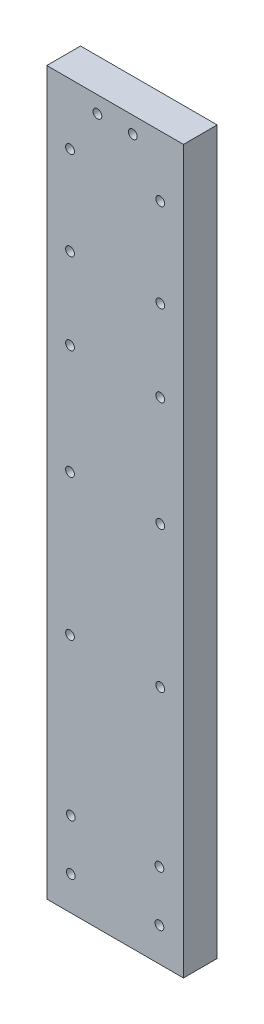
ISO-10303-21;
HEADER;
FILE_DESCRIPTION(('STEP AP214'),'2;1');
FILE_NAME('part.step','',(''),(''),'','','');
FILE_SCHEMA(('AUTOMOTIVE_DESIGN { 1 0 10303 214 1 1 1 1 }'));
ENDSEC;
DATA;
#1=APPLICATION_CONTEXT('core data for automotive mechanical design processes');
#2=APPLICATION_PROTOCOL_DEFINITION('international standard','automotive_design',2000,#1);
#3=PRODUCT_CONTEXT('',#1,'mechanical');
#4=PRODUCT('Part','Part','',(#3));
#5=PRODUCT_RELATED_PRODUCT_CATEGORY('part','',(#4));
#6=PRODUCT_DEFINITION_FORMATION('','',#4);
#7=PRODUCT_DEFINITION_CONTEXT('part definition',#1,'design');
#8=PRODUCT_DEFINITION('design','',#6,#7);
#9=PRODUCT_DEFINITION_SHAPE('','',#8);
#10=(LENGTH_UNIT() NAMED_UNIT(*) SI_UNIT(.MILLI.,.METRE.));
#11=(NAMED_UNIT(*) PLANE_ANGLE_UNIT() SI_UNIT($,.RADIAN.));
#12=(NAMED_UNIT(*) SI_UNIT($,.STERADIAN.) SOLID_ANGLE_UNIT());
#13=UNCERTAINTY_MEASURE_WITH_UNIT(LENGTH_MEASURE(1.E-05),#10,'distance_accuracy_value','');
#14=(GEOMETRIC_REPRESENTATION_CONTEXT(3) GLOBAL_UNCERTAINTY_ASSIGNED_CONTEXT((#13)) GLOBAL_UNIT_ASSIGNED_CONTEXT((#10,
#11,#12)) REPRESENTATION_CONTEXT('',''));
#15=CARTESIAN_POINT('',(0.,0.,0.));
#16=DIRECTION('',(0.,0.,1.));
#17=DIRECTION('',(1.,0.,0.));
#18=AXIS2_PLACEMENT_3D('',#15,#16,#17);
#19=CARTESIAN_POINT('',(0.,0.,4.));
#20=DIRECTION('',(0.,0.,-1.));
#21=DIRECTION('',(-1.,0.,0.));
#22=AXIS2_PLACEMENT_3D('',#19,#20,#21);
#23=PLANE('',#22);
#24=CARTESIAN_POINT('',(10.2,83.635,4.));
#25=DIRECTION('',(0.,0.,1.));
#26=DIRECTION('',(1.,0.,0.));
#27=AXIS2_PLACEMENT_3D('',#24,#25,#26);
#28=CIRCLE('',#27,0.519960121099865);
#29=CARTESIAN_POINT('',(10.7199601210999,83.635,4.));
#30=VERTEX_POINT('',#29);
#31=EDGE_CURVE('E193',#30,#30,#28,.T.);
#32=ORIENTED_EDGE('',*,*,#31,.F.);
#33=EDGE_LOOP('',(#32));
#34=FACE_BOUND('',#33,.T.);
#35=CARTESIAN_POINT('',(13.45,78.385,4.));
#36=DIRECTION('',(0.,0.,1.));
#37=DIRECTION('',(1.,0.,0.));
#38=AXIS2_PLACEMENT_3D('',#35,#36,#37);
#39=CIRCLE('',#38,0.519960121099861);
#40=CARTESIAN_POINT('',(13.9699601210999,78.385,4.));
#41=VERTEX_POINT('',#40);
#42=EDGE_CURVE('E181',#41,#41,#39,.T.);
#43=ORIENTED_EDGE('',*,*,#42,.F.);
#44=EDGE_LOOP('',(#43));
#45=FACE_BOUND('',#44,.T.);
#46=CARTESIAN_POINT('',(13.35,4.,4.));
#47=DIRECTION('',(0.,0.,1.));
#48=DIRECTION('',(-1.,0.,0.));
#49=AXIS2_PLACEMENT_3D('',#46,#47,#48);
#50=CIRCLE('',#49,0.519960121099866);
#51=CARTESIAN_POINT('',(12.8300398789001,4.,4.));
#52=VERTEX_POINT('',#51);
#53=EDGE_CURVE('E169',#52,#52,#50,.T.);
#54=ORIENTED_EDGE('',*,*,#53,.F.);
#55=EDGE_LOOP('',(#54));
#56=FACE_BOUND('',#55,.T.);
#57=CARTESIAN_POINT('',(2.85,4.,4.));
#58=DIRECTION('',(0.,0.,1.));
#59=DIRECTION('',(1.,0.,0.));
#60=AXIS2_PLACEMENT_3D('',#57,#58,#59);
#61=CIRCLE('',#60,0.519960121099866);
#62=CARTESIAN_POINT('',(3.36996012109987,4.,4.));
#63=VERTEX_POINT('',#62);
#64=EDGE_CURVE('E157',#63,#63,#61,.T.);
#65=ORIENTED_EDGE('',*,*,#64,.F.);
#66=EDGE_LOOP('',(#65));
#67=FACE_BOUND('',#66,.T.);
#68=CARTESIAN_POINT('',(13.45,67.885,4.));
#69=DIRECTION('',(0.,0.,1.));
#70=DIRECTION('',(1.,0.,0.));
#71=AXIS2_PLACEMENT_3D('',#68,#69,#70);
#72=CIRCLE('',#71,0.519960121099861);
#73=CARTESIAN_POINT('',(13.9699601210999,67.885,4.));
#74=VERTEX_POINT('',#73);
#75=EDGE_CURVE('E145',#74,#74,#72,.T.);
#76=ORIENTED_EDGE('',*,*,#75,.F.);
#77=EDGE_LOOP('',(#76));
#78=FACE_BOUND('',#77,.T.);
#79=CARTESIAN_POINT('',(13.45,58.24,4.));
#80=DIRECTION('',(0.,0.,1.));
#81=DIRECTION('',(1.,0.,0.));
#82=AXIS2_PLACEMENT_3D('',#79,#80,#81);
#83=CIRCLE('',#82,0.519960121099861);
#84=CARTESIAN_POINT('',(13.9699601210999,58.24,4.));
#85=VERTEX_POINT('',#84);
#86=EDGE_CURVE('E133',#85,#85,#83,.T.);
#87=ORIENTED_EDGE('',*,*,#86,.F.);
#88=EDGE_LOOP('',(#87));
#89=FACE_BOUND('',#88,.T.);
#90=CARTESIAN_POINT('',(13.45,45.24,4.));
#91=DIRECTION('',(0.,0.,1.));
#92=DIRECTION('',(1.,0.,0.));
#93=AXIS2_PLACEMENT_3D('',#90,#91,#92);
#94=CIRCLE('',#93,0.519960121099861);
#95=CARTESIAN_POINT('',(13.9699601210999,45.24,4.));
#96=VERTEX_POINT('',#95);
#97=EDGE_CURVE('E121',#96,#96,#94,.T.);
#98=ORIENTED_EDGE('',*,*,#97,.F.);
#99=EDGE_LOOP('',(#98));
#100=FACE_BOUND('',#99,.T.);
#101=CARTESIAN_POINT('',(13.45,28.5,4.));
#102=DIRECTION('',(0.,0.,1.));
#103=DIRECTION('',(1.,0.,0.));
#104=AXIS2_PLACEMENT_3D('',#101,#102,#103);
#105=CIRCLE('',#104,0.519960121099865);
#106=CARTESIAN_POINT('',(13.9699601210999,28.5,4.));
#107=VERTEX_POINT('',#106);
#108=EDGE_CURVE('E100',#107,#107,#105,.T.);
#109=ORIENTED_EDGE('',*,*,#108,.F.);
#110=EDGE_LOOP('',(#109));
#111=FACE_BOUND('',#110,.T.);
#112=DIRECTION('',(-1.,0.,0.));
#113=VECTOR('',#112,1.);
#114=CARTESIAN_POINT('',(16.2,85.59,4.));
#115=LINE('',#114,#113);
#116=CARTESIAN_POINT('',(16.2,85.59,4.));
#117=VERTEX_POINT('',#116);
#118=CARTESIAN_POINT('',(0.,85.59,4.));
#119=VERTEX_POINT('',#118);
#120=EDGE_CURVE('E85',#117,#119,#115,.T.);
#121=ORIENTED_EDGE('',*,*,#120,.T.);
#122=DIRECTION('',(0.,-1.,0.));
#123=VECTOR('',#122,1.);
#124=CARTESIAN_POINT('',(0.,0.,4.));
#125=LINE('',#124,#123);
#126=CARTESIAN_POINT('',(0.,0.,4.));
#127=VERTEX_POINT('',#126);
#128=EDGE_CURVE('E80',#119,#127,#125,.T.);
#129=ORIENTED_EDGE('',*,*,#128,.T.);
#130=DIRECTION('',(1.,0.,0.));
#131=VECTOR('',#130,1.);
#132=CARTESIAN_POINT('',(0.,0.,4.));
#133=LINE('',#132,#131);
#134=CARTESIAN_POINT('',(16.2,0.,4.));
#135=VERTEX_POINT('',#134);
#136=EDGE_CURVE('E83',#127,#135,#133,.T.);
#137=ORIENTED_EDGE('',*,*,#136,.T.);
#138=DIRECTION('',(0.,1.,0.));
#139=VECTOR('',#138,1.);
#140=CARTESIAN_POINT('',(16.2,0.,4.));
#141=LINE('',#140,#139);
#142=EDGE_CURVE('E50',#135,#117,#141,.T.);
#143=ORIENTED_EDGE('',*,*,#142,.T.);
#144=EDGE_LOOP('',(#121,#129,#137,#143));
#145=FACE_BOUND('',#144,.T.);
#146=CARTESIAN_POINT('',(2.75,28.5,4.));
#147=DIRECTION('',(0.,0.,1.));
#148=DIRECTION('',(1.,0.,0.));
#149=AXIS2_PLACEMENT_3D('',#146,#147,#148);
#150=CIRCLE('',#149,0.519960121099867);
#151=CARTESIAN_POINT('',(3.26996012109987,28.5,4.));
#152=VERTEX_POINT('',#151);
#153=EDGE_CURVE('E115',#152,#152,#150,.T.);
#154=ORIENTED_EDGE('',*,*,#153,.F.);
#155=EDGE_LOOP('',(#154));
#156=FACE_BOUND('',#155,.T.);
#157=CARTESIAN_POINT('',(2.75,45.24,4.));
#158=DIRECTION('',(0.,0.,1.));
#159=DIRECTION('',(1.,0.,0.));
#160=AXIS2_PLACEMENT_3D('',#157,#158,#159);
#161=CIRCLE('',#160,0.519960121099858);
#162=CARTESIAN_POINT('',(3.26996012109986,45.24,4.));
#163=VERTEX_POINT('',#162);
#164=EDGE_CURVE('E127',#163,#163,#161,.T.);
#165=ORIENTED_EDGE('',*,*,#164,.F.);
#166=EDGE_LOOP('',(#165));
#167=FACE_BOUND('',#166,.T.);
#168=CARTESIAN_POINT('',(2.75,58.24,4.));
#169=DIRECTION('',(0.,0.,1.));
#170=DIRECTION('',(1.,0.,0.));
#171=AXIS2_PLACEMENT_3D('',#168,#169,#170);
#172=CIRCLE('',#171,0.519960121099858);
#173=CARTESIAN_POINT('',(3.26996012109986,58.24,4.));
#174=VERTEX_POINT('',#173);
#175=EDGE_CURVE('E139',#174,#174,#172,.T.);
#176=ORIENTED_EDGE('',*,*,#175,.F.);
#177=EDGE_LOOP('',(#176));
#178=FACE_BOUND('',#177,.T.);
#179=CARTESIAN_POINT('',(2.85,10.,4.));
#180=DIRECTION('',(0.,0.,1.));
#181=DIRECTION('',(1.,0.,0.));
#182=AXIS2_PLACEMENT_3D('',#179,#180,#181);
#183=CIRCLE('',#182,0.519960121099866);
#184=CARTESIAN_POINT('',(3.36996012109986,10.,4.));
#185=VERTEX_POINT('',#184);
#186=EDGE_CURVE('E151',#185,#185,#183,.T.);
#187=ORIENTED_EDGE('',*,*,#186,.F.);
#188=EDGE_LOOP('',(#187));
#189=FACE_BOUND('',#188,.T.);
#190=CARTESIAN_POINT('',(13.3499999999999,10.,4.));
#191=DIRECTION('',(0.,0.,1.));
#192=DIRECTION('',(-1.,0.,0.));
#193=AXIS2_PLACEMENT_3D('',#190,#191,#192);
#194=CIRCLE('',#193,0.519960121099864);
#195=CARTESIAN_POINT('',(12.8300398789,10.,4.));
#196=VERTEX_POINT('',#195);
#197=EDGE_CURVE('E163',#196,#196,#194,.T.);
#198=ORIENTED_EDGE('',*,*,#197,.F.);
#199=EDGE_LOOP('',(#198));
#200=FACE_BOUND('',#199,.T.);
#201=CARTESIAN_POINT('',(2.74999999999862,67.885,4.));
#202=DIRECTION('',(0.,0.,1.));
#203=DIRECTION('',(1.,0.,0.));
#204=AXIS2_PLACEMENT_3D('',#201,#202,#203);
#205=CIRCLE('',#204,0.519960121099858);
#206=CARTESIAN_POINT('',(3.26996012109847,67.885,4.));
#207=VERTEX_POINT('',#206);
#208=EDGE_CURVE('E175',#207,#207,#205,.T.);
#209=ORIENTED_EDGE('',*,*,#208,.F.);
#210=EDGE_LOOP('',(#209));
#211=FACE_BOUND('',#210,.T.);
#212=CARTESIAN_POINT('',(2.74999999999862,78.385,4.));
#213=DIRECTION('',(0.,0.,1.));
#214=DIRECTION('',(1.,0.,0.));
#215=AXIS2_PLACEMENT_3D('',#212,#213,#214);
#216=CIRCLE('',#215,0.519960121099858);
#217=CARTESIAN_POINT('',(3.26996012109847,78.385,4.));
#218=VERTEX_POINT('',#217);
#219=EDGE_CURVE('E187',#218,#218,#216,.T.);
#220=ORIENTED_EDGE('',*,*,#219,.F.);
#221=EDGE_LOOP('',(#220));
#222=FACE_BOUND('',#221,.T.);
#223=CARTESIAN_POINT('',(6.,83.635,4.));
#224=DIRECTION('',(0.,0.,1.));
#225=DIRECTION('',(1.,0.,0.));
#226=AXIS2_PLACEMENT_3D('',#223,#224,#225);
#227=CIRCLE('',#226,0.519960121099862);
#228=CARTESIAN_POINT('',(6.51996012109986,83.635,4.));
#229=VERTEX_POINT('',#228);
#230=EDGE_CURVE('E199',#229,#229,#227,.T.);
#231=ORIENTED_EDGE('',*,*,#230,.F.);
#232=EDGE_LOOP('',(#231));
#233=FACE_BOUND('',#232,.T.);
#234=ADVANCED_FACE('F33',(#34,#45,#56,#67,#78,#89,#100,#111,#145,#156,#167,#178,#189,#200,#211,
#222,#233),#23,.F.);
#235=CARTESIAN_POINT('',(0.,0.,0.));
#236=DIRECTION('',(0.,0.,-1.));
#237=DIRECTION('',(-1.,0.,0.));
#238=AXIS2_PLACEMENT_3D('',#235,#236,#237);
#239=PLANE('',#238);
#240=CARTESIAN_POINT('',(10.2,83.635,0.));
#241=DIRECTION('',(0.,0.,1.));
#242=DIRECTION('',(1.,0.,0.));
#243=AXIS2_PLACEMENT_3D('',#240,#241,#242);
#244=CIRCLE('',#243,0.519960121099865);
#245=CARTESIAN_POINT('',(10.7199601210999,83.635,0.));
#246=VERTEX_POINT('',#245);
#247=EDGE_CURVE('E196',#246,#246,#244,.T.);
#248=ORIENTED_EDGE('',*,*,#247,.T.);
#249=EDGE_LOOP('',(#248));
#250=FACE_BOUND('',#249,.T.);
#251=CARTESIAN_POINT('',(13.45,78.385,0.));
#252=DIRECTION('',(0.,0.,1.));
#253=DIRECTION('',(1.,0.,0.));
#254=AXIS2_PLACEMENT_3D('',#251,#252,#253);
#255=CIRCLE('',#254,0.519960121099861);
#256=CARTESIAN_POINT('',(13.9699601210999,78.385,0.));
#257=VERTEX_POINT('',#256);
#258=EDGE_CURVE('E184',#257,#257,#255,.T.);
#259=ORIENTED_EDGE('',*,*,#258,.T.);
#260=EDGE_LOOP('',(#259));
#261=FACE_BOUND('',#260,.T.);
#262=CARTESIAN_POINT('',(13.35,4.,0.));
#263=DIRECTION('',(0.,0.,1.));
#264=DIRECTION('',(-1.,0.,0.));
#265=AXIS2_PLACEMENT_3D('',#262,#263,#264);
#266=CIRCLE('',#265,0.519960121099866);
#267=CARTESIAN_POINT('',(12.8300398789001,4.,0.));
#268=VERTEX_POINT('',#267);
#269=EDGE_CURVE('E172',#268,#268,#266,.T.);
#270=ORIENTED_EDGE('',*,*,#269,.T.);
#271=EDGE_LOOP('',(#270));
#272=FACE_BOUND('',#271,.T.);
#273=CARTESIAN_POINT('',(2.85,4.,0.));
#274=DIRECTION('',(0.,0.,1.));
#275=DIRECTION('',(1.,0.,0.));
#276=AXIS2_PLACEMENT_3D('',#273,#274,#275);
#277=CIRCLE('',#276,0.519960121099866);
#278=CARTESIAN_POINT('',(3.36996012109987,4.,0.));
#279=VERTEX_POINT('',#278);
#280=EDGE_CURVE('E160',#279,#279,#277,.T.);
#281=ORIENTED_EDGE('',*,*,#280,.T.);
#282=EDGE_LOOP('',(#281));
#283=FACE_BOUND('',#282,.T.);
#284=CARTESIAN_POINT('',(13.45,67.885,0.));
#285=DIRECTION('',(0.,0.,1.));
#286=DIRECTION('',(1.,0.,0.));
#287=AXIS2_PLACEMENT_3D('',#284,#285,#286);
#288=CIRCLE('',#287,0.519960121099861);
#289=CARTESIAN_POINT('',(13.9699601210999,67.885,0.));
#290=VERTEX_POINT('',#289);
#291=EDGE_CURVE('E148',#290,#290,#288,.T.);
#292=ORIENTED_EDGE('',*,*,#291,.T.);
#293=EDGE_LOOP('',(#292));
#294=FACE_BOUND('',#293,.T.);
#295=CARTESIAN_POINT('',(13.45,58.24,0.));
#296=DIRECTION('',(0.,0.,1.));
#297=DIRECTION('',(1.,0.,0.));
#298=AXIS2_PLACEMENT_3D('',#295,#296,#297);
#299=CIRCLE('',#298,0.519960121099861);
#300=CARTESIAN_POINT('',(13.9699601210999,58.24,0.));
#301=VERTEX_POINT('',#300);
#302=EDGE_CURVE('E136',#301,#301,#299,.T.);
#303=ORIENTED_EDGE('',*,*,#302,.T.);
#304=EDGE_LOOP('',(#303));
#305=FACE_BOUND('',#304,.T.);
#306=CARTESIAN_POINT('',(13.45,45.24,0.));
#307=DIRECTION('',(0.,0.,1.));
#308=DIRECTION('',(1.,0.,0.));
#309=AXIS2_PLACEMENT_3D('',#306,#307,#308);
#310=CIRCLE('',#309,0.519960121099861);
#311=CARTESIAN_POINT('',(13.9699601210999,45.24,0.));
#312=VERTEX_POINT('',#311);
#313=EDGE_CURVE('E124',#312,#312,#310,.T.);
#314=ORIENTED_EDGE('',*,*,#313,.T.);
#315=EDGE_LOOP('',(#314));
#316=FACE_BOUND('',#315,.T.);
#317=CARTESIAN_POINT('',(13.45,28.5,0.));
#318=DIRECTION('',(0.,0.,1.));
#319=DIRECTION('',(1.,0.,0.));
#320=AXIS2_PLACEMENT_3D('',#317,#318,#319);
#321=CIRCLE('',#320,0.519960121099865);
#322=CARTESIAN_POINT('',(13.9699601210999,28.5,0.));
#323=VERTEX_POINT('',#322);
#324=EDGE_CURVE('E112',#323,#323,#321,.T.);
#325=ORIENTED_EDGE('',*,*,#324,.T.);
#326=EDGE_LOOP('',(#325));
#327=FACE_BOUND('',#326,.T.);
#328=DIRECTION('',(-1.,0.,0.));
#329=VECTOR('',#328,1.);
#330=CARTESIAN_POINT('',(16.2,85.59,0.));
#331=LINE('',#330,#329);
#332=CARTESIAN_POINT('',(16.2,85.59,0.));
#333=VERTEX_POINT('',#332);
#334=CARTESIAN_POINT('',(0.,85.59,0.));
#335=VERTEX_POINT('',#334);
#336=EDGE_CURVE('E97',#333,#335,#331,.T.);
#337=ORIENTED_EDGE('',*,*,#336,.F.);
#338=DIRECTION('',(0.,1.,0.));
#339=VECTOR('',#338,1.);
#340=CARTESIAN_POINT('',(16.2,0.,0.));
#341=LINE('',#340,#339);
#342=CARTESIAN_POINT('',(16.2,0.,0.));
#343=VERTEX_POINT('',#342);
#344=EDGE_CURVE('E73',#343,#333,#341,.T.);
#345=ORIENTED_EDGE('',*,*,#344,.F.);
#346=DIRECTION('',(1.,0.,0.));
#347=VECTOR('',#346,1.);
#348=CARTESIAN_POINT('',(0.,0.,0.));
#349=LINE('',#348,#347);
#350=CARTESIAN_POINT('',(0.,0.,0.));
#351=VERTEX_POINT('',#350);
#352=EDGE_CURVE('E67',#351,#343,#349,.T.);
#353=ORIENTED_EDGE('',*,*,#352,.F.);
#354=DIRECTION('',(0.,-1.,0.));
#355=VECTOR('',#354,1.);
#356=CARTESIAN_POINT('',(0.,0.,0.));
#357=LINE('',#356,#355);
#358=EDGE_CURVE('E89',#335,#351,#357,.T.);
#359=ORIENTED_EDGE('',*,*,#358,.F.);
#360=EDGE_LOOP('',(#337,#345,#353,#359));
#361=FACE_BOUND('',#360,.T.);
#362=CARTESIAN_POINT('',(2.75,28.5,0.));
#363=DIRECTION('',(0.,0.,1.));
#364=DIRECTION('',(1.,0.,0.));
#365=AXIS2_PLACEMENT_3D('',#362,#363,#364);
#366=CIRCLE('',#365,0.519960121099867);
#367=CARTESIAN_POINT('',(3.26996012109987,28.5,0.));
#368=VERTEX_POINT('',#367);
#369=EDGE_CURVE('E118',#368,#368,#366,.T.);
#370=ORIENTED_EDGE('',*,*,#369,.T.);
#371=EDGE_LOOP('',(#370));
#372=FACE_BOUND('',#371,.T.);
#373=CARTESIAN_POINT('',(2.75,45.24,0.));
#374=DIRECTION('',(0.,0.,1.));
#375=DIRECTION('',(1.,0.,0.));
#376=AXIS2_PLACEMENT_3D('',#373,#374,#375);
#377=CIRCLE('',#376,0.519960121099858);
#378=CARTESIAN_POINT('',(3.26996012109986,45.24,0.));
#379=VERTEX_POINT('',#378);
#380=EDGE_CURVE('E130',#379,#379,#377,.T.);
#381=ORIENTED_EDGE('',*,*,#380,.T.);
#382=EDGE_LOOP('',(#381));
#383=FACE_BOUND('',#382,.T.);
#384=CARTESIAN_POINT('',(2.75,58.24,0.));
#385=DIRECTION('',(0.,0.,1.));
#386=DIRECTION('',(1.,0.,0.));
#387=AXIS2_PLACEMENT_3D('',#384,#385,#386);
#388=CIRCLE('',#387,0.519960121099858);
#389=CARTESIAN_POINT('',(3.26996012109986,58.24,0.));
#390=VERTEX_POINT('',#389);
#391=EDGE_CURVE('E142',#390,#390,#388,.T.);
#392=ORIENTED_EDGE('',*,*,#391,.T.);
#393=EDGE_LOOP('',(#392));
#394=FACE_BOUND('',#393,.T.);
#395=CARTESIAN_POINT('',(2.85,10.,0.));
#396=DIRECTION('',(0.,0.,1.));
#397=DIRECTION('',(1.,0.,0.));
#398=AXIS2_PLACEMENT_3D('',#395,#396,#397);
#399=CIRCLE('',#398,0.519960121099866);
#400=CARTESIAN_POINT('',(3.36996012109986,10.,0.));
#401=VERTEX_POINT('',#400);
#402=EDGE_CURVE('E154',#401,#401,#399,.T.);
#403=ORIENTED_EDGE('',*,*,#402,.T.);
#404=EDGE_LOOP('',(#403));
#405=FACE_BOUND('',#404,.T.);
#406=CARTESIAN_POINT('',(13.3499999999999,10.,0.));
#407=DIRECTION('',(0.,0.,1.));
#408=DIRECTION('',(-1.,0.,0.));
#409=AXIS2_PLACEMENT_3D('',#406,#407,#408);
#410=CIRCLE('',#409,0.519960121099864);
#411=CARTESIAN_POINT('',(12.8300398789,10.,0.));
#412=VERTEX_POINT('',#411);
#413=EDGE_CURVE('E166',#412,#412,#410,.T.);
#414=ORIENTED_EDGE('',*,*,#413,.T.);
#415=EDGE_LOOP('',(#414));
#416=FACE_BOUND('',#415,.T.);
#417=CARTESIAN_POINT('',(2.74999999999862,67.885,0.));
#418=DIRECTION('',(0.,0.,1.));
#419=DIRECTION('',(1.,0.,0.));
#420=AXIS2_PLACEMENT_3D('',#417,#418,#419);
#421=CIRCLE('',#420,0.519960121099858);
#422=CARTESIAN_POINT('',(3.26996012109847,67.885,0.));
#423=VERTEX_POINT('',#422);
#424=EDGE_CURVE('E178',#423,#423,#421,.T.);
#425=ORIENTED_EDGE('',*,*,#424,.T.);
#426=EDGE_LOOP('',(#425));
#427=FACE_BOUND('',#426,.T.);
#428=CARTESIAN_POINT('',(2.74999999999862,78.385,0.));
#429=DIRECTION('',(0.,0.,1.));
#430=DIRECTION('',(1.,0.,0.));
#431=AXIS2_PLACEMENT_3D('',#428,#429,#430);
#432=CIRCLE('',#431,0.519960121099858);
#433=CARTESIAN_POINT('',(3.26996012109847,78.385,0.));
#434=VERTEX_POINT('',#433);
#435=EDGE_CURVE('E190',#434,#434,#432,.T.);
#436=ORIENTED_EDGE('',*,*,#435,.T.);
#437=EDGE_LOOP('',(#436));
#438=FACE_BOUND('',#437,.T.);
#439=CARTESIAN_POINT('',(6.,83.635,0.));
#440=DIRECTION('',(0.,0.,1.));
#441=DIRECTION('',(1.,0.,0.));
#442=AXIS2_PLACEMENT_3D('',#439,#440,#441);
#443=CIRCLE('',#442,0.519960121099862);
#444=CARTESIAN_POINT('',(6.51996012109986,83.635,0.));
#445=VERTEX_POINT('',#444);
#446=EDGE_CURVE('E202',#445,#445,#443,.T.);
#447=ORIENTED_EDGE('',*,*,#446,.T.);
#448=EDGE_LOOP('',(#447));
#449=FACE_BOUND('',#448,.T.);
#450=ADVANCED_FACE('F108',(#250,#261,#272,#283,#294,#305,#316,#327,#361,#372,#383,#394,#405,
#416,#427,#438,#449),#239,.T.);
#451=CARTESIAN_POINT('',(16.2,85.59,4.));
#452=DIRECTION('',(0.,-1.,0.));
#453=DIRECTION('',(0.,0.,-1.));
#454=AXIS2_PLACEMENT_3D('',#451,#452,#453);
#455=PLANE('',#454);
#456=ORIENTED_EDGE('',*,*,#336,.T.);
#457=DIRECTION('',(0.,0.,-1.));
#458=VECTOR('',#457,1.);
#459=CARTESIAN_POINT('',(0.,85.59,4.));
#460=LINE('',#459,#458);
#461=EDGE_CURVE('E11',#119,#335,#460,.T.);
#462=ORIENTED_EDGE('',*,*,#461,.F.);
#463=ORIENTED_EDGE('',*,*,#120,.F.);
#464=DIRECTION('',(0.,0.,-1.));
#465=VECTOR('',#464,1.);
#466=CARTESIAN_POINT('',(16.2,85.59,4.));
#467=LINE('',#466,#465);
#468=EDGE_CURVE('E93',#117,#333,#467,.T.);
#469=ORIENTED_EDGE('',*,*,#468,.T.);
#470=EDGE_LOOP('',(#456,#462,#463,#469));
#471=FACE_BOUND('',#470,.T.);
#472=ADVANCED_FACE('F35',(#471),#455,.F.);
#473=CARTESIAN_POINT('',(0.,0.,4.));
#474=DIRECTION('',(1.,0.,0.));
#475=DIRECTION('',(0.,0.,-1.));
#476=AXIS2_PLACEMENT_3D('',#473,#474,#475);
#477=PLANE('',#476);
#478=ORIENTED_EDGE('',*,*,#358,.T.);
#479=DIRECTION('',(0.,0.,-1.));
#480=VECTOR('',#479,1.);
#481=CARTESIAN_POINT('',(0.,0.,4.));
#482=LINE('',#481,#480);
#483=EDGE_CURVE('E42',#127,#351,#482,.T.);
#484=ORIENTED_EDGE('',*,*,#483,.F.);
#485=ORIENTED_EDGE('',*,*,#128,.F.);
#486=ORIENTED_EDGE('',*,*,#461,.T.);
#487=EDGE_LOOP('',(#478,#484,#485,#486));
#488=FACE_BOUND('',#487,.T.);
#489=ADVANCED_FACE('F88',(#488),#477,.F.);
#490=CARTESIAN_POINT('',(0.,0.,4.));
#491=DIRECTION('',(0.,1.,0.));
#492=DIRECTION('',(0.,0.,1.));
#493=AXIS2_PLACEMENT_3D('',#490,#491,#492);
#494=PLANE('',#493);
#495=ORIENTED_EDGE('',*,*,#352,.T.);
#496=DIRECTION('',(0.,0.,-1.));
#497=VECTOR('',#496,1.);
#498=CARTESIAN_POINT('',(16.2,0.,4.));
#499=LINE('',#498,#497);
#500=EDGE_CURVE('E90',#135,#343,#499,.T.);
#501=ORIENTED_EDGE('',*,*,#500,.F.);
#502=ORIENTED_EDGE('',*,*,#136,.F.);
#503=ORIENTED_EDGE('',*,*,#483,.T.);
#504=EDGE_LOOP('',(#495,#501,#502,#503));
#505=FACE_BOUND('',#504,.T.);
#506=ADVANCED_FACE('F91',(#505),#494,.F.);
#507=CARTESIAN_POINT('',(16.2,0.,4.));
#508=DIRECTION('',(-1.,0.,0.));
#509=DIRECTION('',(0.,0.,1.));
#510=AXIS2_PLACEMENT_3D('',#507,#508,#509);
#511=PLANE('',#510);
#512=ORIENTED_EDGE('',*,*,#344,.T.);
#513=ORIENTED_EDGE('',*,*,#468,.F.);
#514=ORIENTED_EDGE('',*,*,#142,.F.);
#515=ORIENTED_EDGE('',*,*,#500,.T.);
#516=EDGE_LOOP('',(#512,#513,#514,#515));
#517=FACE_BOUND('',#516,.T.);
#518=ADVANCED_FACE('F105',(#517),#511,.F.);
#519=CARTESIAN_POINT('',(13.45,28.5,4.));
#520=DIRECTION('',(0.,0.,-1.));
#521=DIRECTION('',(-1.,0.,0.));
#522=AXIS2_PLACEMENT_3D('',#519,#520,#521);
#523=CYLINDRICAL_SURFACE('',#522,0.519960121099865);
#524=ORIENTED_EDGE('',*,*,#108,.T.);
#525=EDGE_LOOP('',(#524));
#526=FACE_BOUND('',#525,.T.);
#527=ORIENTED_EDGE('',*,*,#324,.F.);
#528=EDGE_LOOP('',(#527));
#529=FACE_BOUND('',#528,.T.);
#530=ADVANCED_FACE('F222',(#526,#529),#523,.F.);
#531=CARTESIAN_POINT('',(2.75,28.5,4.));
#532=DIRECTION('',(0.,0.,-1.));
#533=DIRECTION('',(-1.,0.,0.));
#534=AXIS2_PLACEMENT_3D('',#531,#532,#533);
#535=CYLINDRICAL_SURFACE('',#534,0.519960121099867);
#536=ORIENTED_EDGE('',*,*,#153,.T.);
#537=EDGE_LOOP('',(#536));
#538=FACE_BOUND('',#537,.T.);
#539=ORIENTED_EDGE('',*,*,#369,.F.);
#540=EDGE_LOOP('',(#539));
#541=FACE_BOUND('',#540,.T.);
#542=ADVANCED_FACE('F268',(#538,#541),#535,.F.);
#543=CARTESIAN_POINT('',(13.45,45.24,4.));
#544=DIRECTION('',(0.,0.,-1.));
#545=DIRECTION('',(-1.,0.,0.));
#546=AXIS2_PLACEMENT_3D('',#543,#544,#545);
#547=CYLINDRICAL_SURFACE('',#546,0.519960121099861);
#548=ORIENTED_EDGE('',*,*,#97,.T.);
#549=EDGE_LOOP('',(#548));
#550=FACE_BOUND('',#549,.T.);
#551=ORIENTED_EDGE('',*,*,#313,.F.);
#552=EDGE_LOOP('',(#551));
#553=FACE_BOUND('',#552,.T.);
#554=ADVANCED_FACE('F276',(#550,#553),#547,.F.);
#555=CARTESIAN_POINT('',(2.75,45.24,4.));
#556=DIRECTION('',(0.,0.,-1.));
#557=DIRECTION('',(-1.,0.,0.));
#558=AXIS2_PLACEMENT_3D('',#555,#556,#557);
#559=CYLINDRICAL_SURFACE('',#558,0.519960121099858);
#560=ORIENTED_EDGE('',*,*,#164,.T.);
#561=EDGE_LOOP('',(#560));
#562=FACE_BOUND('',#561,.T.);
#563=ORIENTED_EDGE('',*,*,#380,.F.);
#564=EDGE_LOOP('',(#563));
#565=FACE_BOUND('',#564,.T.);
#566=ADVANCED_FACE('F284',(#562,#565),#559,.F.);
#567=CARTESIAN_POINT('',(13.45,58.24,4.));
#568=DIRECTION('',(0.,0.,-1.));
#569=DIRECTION('',(-1.,0.,0.));
#570=AXIS2_PLACEMENT_3D('',#567,#568,#569);
#571=CYLINDRICAL_SURFACE('',#570,0.519960121099861);
#572=ORIENTED_EDGE('',*,*,#86,.T.);
#573=EDGE_LOOP('',(#572));
#574=FACE_BOUND('',#573,.T.);
#575=ORIENTED_EDGE('',*,*,#302,.F.);
#576=EDGE_LOOP('',(#575));
#577=FACE_BOUND('',#576,.T.);
#578=ADVANCED_FACE('F293',(#574,#577),#571,.F.);
#579=CARTESIAN_POINT('',(2.75,58.24,4.));
#580=DIRECTION('',(0.,0.,-1.));
#581=DIRECTION('',(-1.,0.,0.));
#582=AXIS2_PLACEMENT_3D('',#579,#580,#581);
#583=CYLINDRICAL_SURFACE('',#582,0.519960121099858);
#584=ORIENTED_EDGE('',*,*,#175,.T.);
#585=EDGE_LOOP('',(#584));
#586=FACE_BOUND('',#585,.T.);
#587=ORIENTED_EDGE('',*,*,#391,.F.);
#588=EDGE_LOOP('',(#587));
#589=FACE_BOUND('',#588,.T.);
#590=ADVANCED_FACE('F302',(#586,#589),#583,.F.);
#591=CARTESIAN_POINT('',(13.45,67.885,4.));
#592=DIRECTION('',(0.,0.,-1.));
#593=DIRECTION('',(-1.,0.,0.));
#594=AXIS2_PLACEMENT_3D('',#591,#592,#593);
#595=CYLINDRICAL_SURFACE('',#594,0.519960121099861);
#596=ORIENTED_EDGE('',*,*,#75,.T.);
#597=EDGE_LOOP('',(#596));
#598=FACE_BOUND('',#597,.T.);
#599=ORIENTED_EDGE('',*,*,#291,.F.);
#600=EDGE_LOOP('',(#599));
#601=FACE_BOUND('',#600,.T.);
#602=ADVANCED_FACE('F311',(#598,#601),#595,.F.);
#603=CARTESIAN_POINT('',(2.85,10.,4.));
#604=DIRECTION('',(0.,0.,-1.));
#605=DIRECTION('',(-1.,0.,0.));
#606=AXIS2_PLACEMENT_3D('',#603,#604,#605);
#607=CYLINDRICAL_SURFACE('',#606,0.519960121099866);
#608=ORIENTED_EDGE('',*,*,#186,.T.);
#609=EDGE_LOOP('',(#608));
#610=FACE_BOUND('',#609,.T.);
#611=ORIENTED_EDGE('',*,*,#402,.F.);
#612=EDGE_LOOP('',(#611));
#613=FACE_BOUND('',#612,.T.);
#614=ADVANCED_FACE('F320',(#610,#613),#607,.F.);
#615=CARTESIAN_POINT('',(2.85,4.,4.));
#616=DIRECTION('',(0.,0.,-1.));
#617=DIRECTION('',(-1.,0.,0.));
#618=AXIS2_PLACEMENT_3D('',#615,#616,#617);
#619=CYLINDRICAL_SURFACE('',#618,0.519960121099866);
#620=ORIENTED_EDGE('',*,*,#64,.T.);
#621=EDGE_LOOP('',(#620));
#622=FACE_BOUND('',#621,.T.);
#623=ORIENTED_EDGE('',*,*,#280,.F.);
#624=EDGE_LOOP('',(#623));
#625=FACE_BOUND('',#624,.T.);
#626=ADVANCED_FACE('F329',(#622,#625),#619,.F.);
#627=CARTESIAN_POINT('',(13.3499999999999,10.,4.));
#628=DIRECTION('',(0.,0.,-1.));
#629=DIRECTION('',(-1.,0.,0.));
#630=AXIS2_PLACEMENT_3D('',#627,#628,#629);
#631=CYLINDRICAL_SURFACE('',#630,0.519960121099864);
#632=ORIENTED_EDGE('',*,*,#197,.T.);
#633=EDGE_LOOP('',(#632));
#634=FACE_BOUND('',#633,.T.);
#635=ORIENTED_EDGE('',*,*,#413,.F.);
#636=EDGE_LOOP('',(#635));
#637=FACE_BOUND('',#636,.T.);
#638=ADVANCED_FACE('F338',(#634,#637),#631,.F.);
#639=CARTESIAN_POINT('',(13.35,4.,4.));
#640=DIRECTION('',(0.,0.,-1.));
#641=DIRECTION('',(-1.,0.,0.));
#642=AXIS2_PLACEMENT_3D('',#639,#640,#641);
#643=CYLINDRICAL_SURFACE('',#642,0.519960121099866);
#644=ORIENTED_EDGE('',*,*,#53,.T.);
#645=EDGE_LOOP('',(#644));
#646=FACE_BOUND('',#645,.T.);
#647=ORIENTED_EDGE('',*,*,#269,.F.);
#648=EDGE_LOOP('',(#647));
#649=FACE_BOUND('',#648,.T.);
#650=ADVANCED_FACE('F347',(#646,#649),#643,.F.);
#651=CARTESIAN_POINT('',(2.74999999999862,67.885,4.));
#652=DIRECTION('',(0.,0.,-1.));
#653=DIRECTION('',(-1.,0.,0.));
#654=AXIS2_PLACEMENT_3D('',#651,#652,#653);
#655=CYLINDRICAL_SURFACE('',#654,0.519960121099858);
#656=ORIENTED_EDGE('',*,*,#208,.T.);
#657=EDGE_LOOP('',(#656));
#658=FACE_BOUND('',#657,.T.);
#659=ORIENTED_EDGE('',*,*,#424,.F.);
#660=EDGE_LOOP('',(#659));
#661=FACE_BOUND('',#660,.T.);
#662=ADVANCED_FACE('F356',(#658,#661),#655,.F.);
#663=CARTESIAN_POINT('',(13.45,78.385,4.));
#664=DIRECTION('',(0.,0.,-1.));
#665=DIRECTION('',(-1.,0.,0.));
#666=AXIS2_PLACEMENT_3D('',#663,#664,#665);
#667=CYLINDRICAL_SURFACE('',#666,0.519960121099861);
#668=ORIENTED_EDGE('',*,*,#42,.T.);
#669=EDGE_LOOP('',(#668));
#670=FACE_BOUND('',#669,.T.);
#671=ORIENTED_EDGE('',*,*,#258,.F.);
#672=EDGE_LOOP('',(#671));
#673=FACE_BOUND('',#672,.T.);
#674=ADVANCED_FACE('F365',(#670,#673),#667,.F.);
#675=CARTESIAN_POINT('',(2.74999999999862,78.385,4.));
#676=DIRECTION('',(0.,0.,-1.));
#677=DIRECTION('',(-1.,0.,0.));
#678=AXIS2_PLACEMENT_3D('',#675,#676,#677);
#679=CYLINDRICAL_SURFACE('',#678,0.519960121099858);
#680=ORIENTED_EDGE('',*,*,#219,.T.);
#681=EDGE_LOOP('',(#680));
#682=FACE_BOUND('',#681,.T.);
#683=ORIENTED_EDGE('',*,*,#435,.F.);
#684=EDGE_LOOP('',(#683));
#685=FACE_BOUND('',#684,.T.);
#686=ADVANCED_FACE('F374',(#682,#685),#679,.F.);
#687=CARTESIAN_POINT('',(10.2,83.635,4.));
#688=DIRECTION('',(0.,0.,-1.));
#689=DIRECTION('',(-1.,0.,0.));
#690=AXIS2_PLACEMENT_3D('',#687,#688,#689);
#691=CYLINDRICAL_SURFACE('',#690,0.519960121099865);
#692=ORIENTED_EDGE('',*,*,#31,.T.);
#693=EDGE_LOOP('',(#692));
#694=FACE_BOUND('',#693,.T.);
#695=ORIENTED_EDGE('',*,*,#247,.F.);
#696=EDGE_LOOP('',(#695));
#697=FACE_BOUND('',#696,.T.);
#698=ADVANCED_FACE('F383',(#694,#697),#691,.F.);
#699=CARTESIAN_POINT('',(6.,83.635,4.));
#700=DIRECTION('',(0.,0.,-1.));
#701=DIRECTION('',(-1.,0.,0.));
#702=AXIS2_PLACEMENT_3D('',#699,#700,#701);
#703=CYLINDRICAL_SURFACE('',#702,0.519960121099862);
#704=ORIENTED_EDGE('',*,*,#230,.T.);
#705=EDGE_LOOP('',(#704));
#706=FACE_BOUND('',#705,.T.);
#707=ORIENTED_EDGE('',*,*,#446,.F.);
#708=EDGE_LOOP('',(#707));
#709=FACE_BOUND('',#708,.T.);
#710=ADVANCED_FACE('F208',(#706,#709),#703,.F.);
#711=CLOSED_SHELL('',(#234,#450,#472,#489,#506,#518,#530,#542,#554,#566,#578,#590,#602,#614,
#626,#638,#650,#662,#674,#686,#698,#710));
#712=MANIFOLD_SOLID_BREP('B2',#711);
#713=ADVANCED_BREP_SHAPE_REPRESENTATION('',(#18,#712),#14);
#714=SHAPE_DEFINITION_REPRESENTATION(#9,#713);
ENDSEC;
END-ISO-10303-21;
